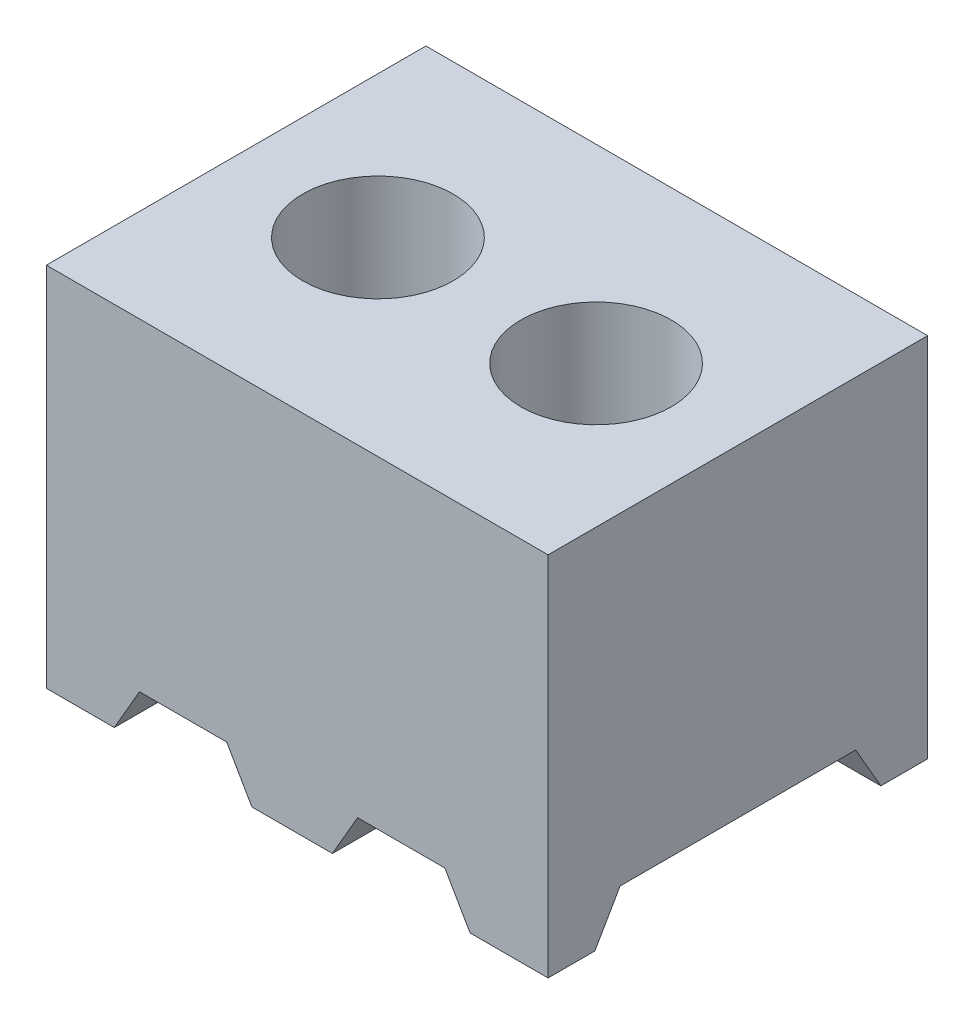
ISO-10303-21;
HEADER;
FILE_DESCRIPTION(('STEP AP214'),'2;1');
FILE_NAME('part.step','',(''),(''),'','','');
FILE_SCHEMA(('AUTOMOTIVE_DESIGN { 1 0 10303 214 1 1 1 1 }'));
ENDSEC;
DATA;
#1=APPLICATION_CONTEXT('core data for automotive mechanical design processes');
#2=APPLICATION_PROTOCOL_DEFINITION('international standard','automotive_design',2000,#1);
#3=PRODUCT_CONTEXT('',#1,'mechanical');
#4=PRODUCT('Part','Part','',(#3));
#5=PRODUCT_RELATED_PRODUCT_CATEGORY('part','',(#4));
#6=PRODUCT_DEFINITION_FORMATION('','',#4);
#7=PRODUCT_DEFINITION_CONTEXT('part definition',#1,'design');
#8=PRODUCT_DEFINITION('design','',#6,#7);
#9=PRODUCT_DEFINITION_SHAPE('','',#8);
#10=(LENGTH_UNIT() NAMED_UNIT(*) SI_UNIT(.MILLI.,.METRE.));
#11=(NAMED_UNIT(*) PLANE_ANGLE_UNIT() SI_UNIT($,.RADIAN.));
#12=(NAMED_UNIT(*) SI_UNIT($,.STERADIAN.) SOLID_ANGLE_UNIT());
#13=UNCERTAINTY_MEASURE_WITH_UNIT(LENGTH_MEASURE(1.E-05),#10,'distance_accuracy_value','');
#14=(GEOMETRIC_REPRESENTATION_CONTEXT(3) GLOBAL_UNCERTAINTY_ASSIGNED_CONTEXT((#13)) GLOBAL_UNIT_ASSIGNED_CONTEXT((#10,
#11,#12)) REPRESENTATION_CONTEXT('',''));
#15=CARTESIAN_POINT('',(0.,0.,0.));
#16=DIRECTION('',(0.,0.,1.));
#17=DIRECTION('',(1.,0.,0.));
#18=AXIS2_PLACEMENT_3D('',#15,#16,#17);
#19=CARTESIAN_POINT('',(0.,-2.1336,0.));
#20=DIRECTION('',(0.,1.,0.));
#21=DIRECTION('',(0.,0.,1.));
#22=AXIS2_PLACEMENT_3D('',#19,#20,#21);
#23=PLANE('',#22);
#24=DIRECTION('',(1.,0.,0.));
#25=VECTOR('',#24,1.);
#26=CARTESIAN_POINT('',(0.,-2.1336,0.));
#27=LINE('',#26,#25);
#28=CARTESIAN_POINT('',(2.46681757469933,-2.1336,0.));
#29=VERTEX_POINT('',#28);
#30=CARTESIAN_POINT('',(2.92099999999999,-2.1336,0.));
#31=VERTEX_POINT('',#30);
#32=EDGE_CURVE('E308',#29,#31,#27,.T.);
#33=ORIENTED_EDGE('',*,*,#32,.F.);
#34=DIRECTION('',(0.,0.,1.));
#35=VECTOR('',#34,1.);
#36=CARTESIAN_POINT('',(2.46681757469933,-2.1336,-2.2098));
#37=LINE('',#36,#35);
#38=CARTESIAN_POINT('',(2.46681757469933,-2.1336,-0.272453031625834));
#39=VERTEX_POINT('',#38);
#40=EDGE_CURVE('E217',#39,#29,#37,.T.);
#41=ORIENTED_EDGE('',*,*,#40,.F.);
#42=DIRECTION('',(1.,0.,0.));
#43=VECTOR('',#42,1.);
#44=CARTESIAN_POINT('',(0.,-2.1336,-0.272453031625834));
#45=LINE('',#44,#43);
#46=CARTESIAN_POINT('',(2.92099999999999,-2.1336,-0.272453031625834));
#47=VERTEX_POINT('',#46);
#48=EDGE_CURVE('E27',#39,#47,#45,.T.);
#49=ORIENTED_EDGE('',*,*,#48,.T.);
#50=DIRECTION('',(0.,0.,-1.));
#51=VECTOR('',#50,1.);
#52=CARTESIAN_POINT('',(2.92099999999999,-2.1336,0.));
#53=LINE('',#52,#51);
#54=EDGE_CURVE('E315',#31,#47,#53,.T.);
#55=ORIENTED_EDGE('',*,*,#54,.F.);
#56=EDGE_LOOP('',(#33,#41,#49,#55));
#57=FACE_BOUND('',#56,.T.);
#58=ADVANCED_FACE('F16',(#57),#23,.F.);
#59=DIRECTION('',(-1.,0.,0.));
#60=VECTOR('',#59,1.);
#61=CARTESIAN_POINT('',(0.,-2.1336,-1.93734696837416));
#62=LINE('',#61,#60);
#63=CARTESIAN_POINT('',(2.92099999999999,-2.1336,-1.93734696837416));
#64=VERTEX_POINT('',#63);
#65=CARTESIAN_POINT('',(2.46681757469933,-2.1336,-1.93734696837416));
#66=VERTEX_POINT('',#65);
#67=EDGE_CURVE('E342',#64,#66,#62,.T.);
#68=ORIENTED_EDGE('',*,*,#67,.T.);
#69=CARTESIAN_POINT('',(2.46681757469933,-2.1336,-2.2098));
#70=VERTEX_POINT('',#69);
#71=EDGE_CURVE('E215',#70,#66,#37,.T.);
#72=ORIENTED_EDGE('',*,*,#71,.F.);
#73=DIRECTION('',(-1.,0.,0.));
#74=VECTOR('',#73,1.);
#75=CARTESIAN_POINT('',(2.92099999999999,-2.1336,-2.20979999999999));
#76=LINE('',#75,#74);
#77=CARTESIAN_POINT('',(2.92099999999999,-2.1336,-2.20979999999999));
#78=VERTEX_POINT('',#77);
#79=EDGE_CURVE('E319',#78,#70,#76,.T.);
#80=ORIENTED_EDGE('',*,*,#79,.F.);
#81=EDGE_CURVE('E313',#64,#78,#53,.T.);
#82=ORIENTED_EDGE('',*,*,#81,.F.);
#83=EDGE_LOOP('',(#68,#72,#80,#82));
#84=FACE_BOUND('',#83,.T.);
#85=ADVANCED_FACE('F369',(#84),#23,.F.);
#86=CARTESIAN_POINT('',(-60.96,-1.8796,-0.4191));
#87=DIRECTION('',(0.,0.500000000000004,0.866025403784436));
#88=DIRECTION('',(0.,-0.866025403784436,0.500000000000004));
#89=AXIS2_PLACEMENT_3D('',#86,#87,#88);
#90=PLANE('',#89);
#91=ORIENTED_EDGE('',*,*,#48,.F.);
#92=DIRECTION('',(-0.447213595499954,0.774596669241483,-0.447213595499962));
#93=VECTOR('',#92,1.);
#94=CARTESIAN_POINT('',(-10.3358635149396,20.0412941203562,-13.075134121265));
#95=LINE('',#94,#93);
#96=CARTESIAN_POINT('',(2.32017060632517,-1.8796,-0.4191));
#97=VERTEX_POINT('',#96);
#98=EDGE_CURVE('E226',#39,#97,#95,.T.);
#99=ORIENTED_EDGE('',*,*,#98,.T.);
#100=DIRECTION('',(1.,0.,0.));
#101=VECTOR('',#100,1.);
#102=CARTESIAN_POINT('',(-60.96,-1.8796,-0.4191));
#103=LINE('',#102,#101);
#104=CARTESIAN_POINT('',(2.92099999999999,-1.8796,-0.4191));
#105=VERTEX_POINT('',#104);
#106=EDGE_CURVE('E294',#97,#105,#103,.T.);
#107=ORIENTED_EDGE('',*,*,#106,.T.);
#108=DIRECTION('',(0.,-0.866025403784436,0.500000000000004));
#109=VECTOR('',#108,1.);
#110=CARTESIAN_POINT('',(2.92099999999999,-1.8796,-0.4191));
#111=LINE('',#110,#109);
#112=EDGE_CURVE('E279',#105,#47,#111,.T.);
#113=ORIENTED_EDGE('',*,*,#112,.T.);
#114=EDGE_LOOP('',(#91,#99,#107,#113));
#115=FACE_BOUND('',#114,.T.);
#116=ADVANCED_FACE('F376',(#115),#90,.F.);
#117=CARTESIAN_POINT('',(-60.96,-1.8796,-1.7907));
#118=DIRECTION('',(0.,0.499999999999978,-0.866025403784451));
#119=DIRECTION('',(0.,0.866025403784451,0.499999999999978));
#120=AXIS2_PLACEMENT_3D('',#117,#118,#119);
#121=PLANE('',#120);
#122=DIRECTION('',(1.,0.,0.));
#123=VECTOR('',#122,1.);
#124=CARTESIAN_POINT('',(-60.96,-1.8796,-1.7907));
#125=LINE('',#124,#123);
#126=CARTESIAN_POINT('',(2.32017060632517,-1.8796,-1.7907));
#127=VERTEX_POINT('',#126);
#128=CARTESIAN_POINT('',(2.92099999999999,-1.8796,-1.7907));
#129=VERTEX_POINT('',#128);
#130=EDGE_CURVE('E288',#127,#129,#125,.T.);
#131=ORIENTED_EDGE('',*,*,#130,.F.);
#132=DIRECTION('',(0.44721359549996,-0.774596669241494,-0.447213595499938));
#133=VECTOR('',#132,1.);
#134=CARTESIAN_POINT('',(-10.33586351494,20.0412941203568,10.8653341212645));
#135=LINE('',#134,#133);
#136=EDGE_CURVE('E223',#127,#66,#135,.T.);
#137=ORIENTED_EDGE('',*,*,#136,.T.);
#138=ORIENTED_EDGE('',*,*,#67,.F.);
#139=DIRECTION('',(0.,0.866025403784451,0.499999999999978));
#140=VECTOR('',#139,1.);
#141=CARTESIAN_POINT('',(2.92099999999999,-1.8796,-1.7907));
#142=LINE('',#141,#140);
#143=EDGE_CURVE('E282',#64,#129,#142,.T.);
#144=ORIENTED_EDGE('',*,*,#143,.T.);
#145=EDGE_LOOP('',(#131,#137,#138,#144));
#146=FACE_BOUND('',#145,.T.);
#147=ADVANCED_FACE('F365',(#146),#121,.F.);
#148=CARTESIAN_POINT('',(1.19681757469933,-2.1336,-0.272453031625834));
#149=VERTEX_POINT('',#148);
#150=CARTESIAN_POINT('',(1.665523637951,-2.1336,-0.272453031625838));
#151=VERTEX_POINT('',#150);
#152=EDGE_CURVE('E25',#149,#151,#45,.T.);
#153=ORIENTED_EDGE('',*,*,#152,.T.);
#154=DIRECTION('',(0.,0.,1.));
#155=VECTOR('',#154,1.);
#156=CARTESIAN_POINT('',(1.665523637951,-2.1336,-2.2098));
#157=LINE('',#156,#155);
#158=CARTESIAN_POINT('',(1.665523637951,-2.1336,0.));
#159=VERTEX_POINT('',#158);
#160=EDGE_CURVE('E191',#151,#159,#157,.T.);
#161=ORIENTED_EDGE('',*,*,#160,.T.);
#162=CARTESIAN_POINT('',(1.19681757469933,-2.1336,0.));
#163=VERTEX_POINT('',#162);
#164=EDGE_CURVE('E314',#163,#159,#27,.T.);
#165=ORIENTED_EDGE('',*,*,#164,.F.);
#166=DIRECTION('',(0.,0.,1.));
#167=VECTOR('',#166,1.);
#168=CARTESIAN_POINT('',(1.19681757469933,-2.1336,-2.2098));
#169=LINE('',#168,#167);
#170=EDGE_CURVE('E254',#149,#163,#169,.T.);
#171=ORIENTED_EDGE('',*,*,#170,.F.);
#172=EDGE_LOOP('',(#153,#161,#165,#171));
#173=FACE_BOUND('',#172,.T.);
#174=ADVANCED_FACE('F378',(#173),#23,.F.);
#175=CARTESIAN_POINT('',(1.665523637951,-2.1336,-2.2098));
#176=VERTEX_POINT('',#175);
#177=CARTESIAN_POINT('',(1.19681757469933,-2.1336,-2.2098));
#178=VERTEX_POINT('',#177);
#179=EDGE_CURVE('E322',#176,#178,#76,.T.);
#180=ORIENTED_EDGE('',*,*,#179,.F.);
#181=CARTESIAN_POINT('',(1.665523637951,-2.1336,-1.93734696837416));
#182=VERTEX_POINT('',#181);
#183=EDGE_CURVE('E34',#176,#182,#157,.T.);
#184=ORIENTED_EDGE('',*,*,#183,.T.);
#185=CARTESIAN_POINT('',(1.19681757469933,-2.1336,-1.93734696837416));
#186=VERTEX_POINT('',#185);
#187=EDGE_CURVE('E344',#182,#186,#62,.T.);
#188=ORIENTED_EDGE('',*,*,#187,.T.);
#189=EDGE_CURVE('E251',#178,#186,#169,.T.);
#190=ORIENTED_EDGE('',*,*,#189,.F.);
#191=EDGE_LOOP('',(#180,#184,#188,#190));
#192=FACE_BOUND('',#191,.T.);
#193=ADVANCED_FACE('F398',(#192),#23,.F.);
#194=CARTESIAN_POINT('',(1.05017060632517,-1.8796,-0.4191));
#195=VERTEX_POINT('',#194);
#196=CARTESIAN_POINT('',(1.81217060632517,-1.8796,-0.4191));
#197=VERTEX_POINT('',#196);
#198=EDGE_CURVE('E293',#195,#197,#103,.T.);
#199=ORIENTED_EDGE('',*,*,#198,.T.);
#200=DIRECTION('',(-0.447213595499954,-0.774596669241483,0.447213595499963));
#201=VECTOR('',#200,1.);
#202=CARTESIAN_POINT('',(-10.7422635149396,-23.6245177583072,12.135334121265));
#203=LINE('',#202,#201);
#204=EDGE_CURVE('E220',#197,#151,#203,.T.);
#205=ORIENTED_EDGE('',*,*,#204,.T.);
#206=ORIENTED_EDGE('',*,*,#152,.F.);
#207=DIRECTION('',(-0.447213595499954,0.774596669241483,-0.447213595499962));
#208=VECTOR('',#207,1.);
#209=CARTESIAN_POINT('',(-11.3518635149396,19.6013532152337,-12.8211341212651));
#210=LINE('',#209,#208);
#211=EDGE_CURVE('E269',#149,#195,#210,.T.);
#212=ORIENTED_EDGE('',*,*,#211,.T.);
#213=EDGE_LOOP('',(#199,#205,#206,#212));
#214=FACE_BOUND('',#213,.T.);
#215=ADVANCED_FACE('F404',(#214),#90,.F.);
#216=ORIENTED_EDGE('',*,*,#187,.F.);
#217=DIRECTION('',(0.44721359549996,0.774596669241494,0.447213595499938));
#218=VECTOR('',#217,1.);
#219=CARTESIAN_POINT('',(-10.74226351494,-23.6245177583078,-14.3451341212645));
#220=LINE('',#219,#218);
#221=CARTESIAN_POINT('',(1.81217060632517,-1.8796,-1.7907));
#222=VERTEX_POINT('',#221);
#223=EDGE_CURVE('E213',#182,#222,#220,.T.);
#224=ORIENTED_EDGE('',*,*,#223,.T.);
#225=CARTESIAN_POINT('',(1.05017060632517,-1.8796,-1.7907));
#226=VERTEX_POINT('',#225);
#227=EDGE_CURVE('E189',#226,#222,#125,.T.);
#228=ORIENTED_EDGE('',*,*,#227,.F.);
#229=DIRECTION('',(0.44721359549996,-0.774596669241494,-0.447213595499938));
#230=VECTOR('',#229,1.);
#231=CARTESIAN_POINT('',(-11.35186351494,19.6013532152343,10.6113341212645));
#232=LINE('',#231,#230);
#233=EDGE_CURVE('E266',#226,#186,#232,.T.);
#234=ORIENTED_EDGE('',*,*,#233,.T.);
#235=EDGE_LOOP('',(#216,#224,#228,#234));
#236=FACE_BOUND('',#235,.T.);
#237=ADVANCED_FACE('F366',(#236),#121,.F.);
#238=CARTESIAN_POINT('',(0.,-2.1336,-0.272453031625834));
#239=VERTEX_POINT('',#238);
#240=CARTESIAN_POINT('',(0.395523637951008,-2.1336,-0.272453031625833));
#241=VERTEX_POINT('',#240);
#242=EDGE_CURVE('E11',#239,#241,#45,.T.);
#243=ORIENTED_EDGE('',*,*,#242,.T.);
#244=DIRECTION('',(0.,0.,1.));
#245=VECTOR('',#244,1.);
#246=CARTESIAN_POINT('',(0.395523637951004,-2.1336,-2.2098));
#247=LINE('',#246,#245);
#248=CARTESIAN_POINT('',(0.395523637951004,-2.1336,0.));
#249=VERTEX_POINT('',#248);
#250=EDGE_CURVE('E258',#241,#249,#247,.T.);
#251=ORIENTED_EDGE('',*,*,#250,.T.);
#252=CARTESIAN_POINT('',(0.,-2.1336,0.));
#253=VERTEX_POINT('',#252);
#254=EDGE_CURVE('E310',#253,#249,#27,.T.);
#255=ORIENTED_EDGE('',*,*,#254,.F.);
#256=DIRECTION('',(0.,0.,1.));
#257=VECTOR('',#256,1.);
#258=CARTESIAN_POINT('',(0.,-2.1336,-2.2098));
#259=LINE('',#258,#257);
#260=EDGE_CURVE('E309',#239,#253,#259,.T.);
#261=ORIENTED_EDGE('',*,*,#260,.F.);
#262=EDGE_LOOP('',(#243,#251,#255,#261));
#263=FACE_BOUND('',#262,.T.);
#264=ADVANCED_FACE('F386',(#263),#23,.F.);
#265=CARTESIAN_POINT('',(0.,-2.1336,-2.2098));
#266=DIRECTION('',(-1.,0.,0.));
#267=DIRECTION('',(0.,0.,1.));
#268=AXIS2_PLACEMENT_3D('',#265,#266,#267);
#269=PLANE('',#268);
#270=DIRECTION('',(0.,0.866025403784436,-0.500000000000004));
#271=VECTOR('',#270,1.);
#272=CARTESIAN_POINT('',(0.,-1.2947041547216,-0.756789773719383));
#273=LINE('',#272,#271);
#274=CARTESIAN_POINT('',(0.,-1.8796,-0.4191));
#275=VERTEX_POINT('',#274);
#276=EDGE_CURVE('E300',#239,#275,#273,.T.);
#277=ORIENTED_EDGE('',*,*,#276,.F.);
#278=ORIENTED_EDGE('',*,*,#260,.T.);
#279=DIRECTION('',(0.,1.,0.));
#280=VECTOR('',#279,1.);
#281=CARTESIAN_POINT('',(0.,-2.1336,0.));
#282=LINE('',#281,#280);
#283=CARTESIAN_POINT('',(0.,0.,0.));
#284=VERTEX_POINT('',#283);
#285=EDGE_CURVE('E321',#253,#284,#282,.T.);
#286=ORIENTED_EDGE('',*,*,#285,.T.);
#287=DIRECTION('',(0.,0.,1.));
#288=VECTOR('',#287,1.);
#289=CARTESIAN_POINT('',(0.,0.,-2.2098));
#290=LINE('',#289,#288);
#291=CARTESIAN_POINT('',(0.,0.,-2.2098));
#292=VERTEX_POINT('',#291);
#293=EDGE_CURVE('E304',#292,#284,#290,.T.);
#294=ORIENTED_EDGE('',*,*,#293,.F.);
#295=DIRECTION('',(0.,1.,0.));
#296=VECTOR('',#295,1.);
#297=CARTESIAN_POINT('',(0.,-2.1336,-2.2098));
#298=LINE('',#297,#296);
#299=CARTESIAN_POINT('',(0.,-2.1336,-2.2098));
#300=VERTEX_POINT('',#299);
#301=EDGE_CURVE('E334',#300,#292,#298,.T.);
#302=ORIENTED_EDGE('',*,*,#301,.F.);
#303=CARTESIAN_POINT('',(0.,-2.1336,-1.93734696837416));
#304=VERTEX_POINT('',#303);
#305=EDGE_CURVE('E305',#300,#304,#259,.T.);
#306=ORIENTED_EDGE('',*,*,#305,.T.);
#307=DIRECTION('',(0.,-0.866025403784451,-0.499999999999978));
#308=VECTOR('',#307,1.);
#309=CARTESIAN_POINT('',(0.,-2.25157562336303,-2.00546022628061));
#310=LINE('',#309,#308);
#311=CARTESIAN_POINT('',(0.,-1.8796,-1.7907));
#312=VERTEX_POINT('',#311);
#313=EDGE_CURVE('E292',#312,#304,#310,.T.);
#314=ORIENTED_EDGE('',*,*,#313,.F.);
#315=DIRECTION('',(0.,0.,-1.));
#316=VECTOR('',#315,1.);
#317=CARTESIAN_POINT('',(0.,-1.8796,-2.2098));
#318=LINE('',#317,#316);
#319=EDGE_CURVE('E302',#275,#312,#318,.T.);
#320=ORIENTED_EDGE('',*,*,#319,.F.);
#321=EDGE_LOOP('',(#277,#278,#286,#294,#302,#306,#314,#320));
#322=FACE_BOUND('',#321,.T.);
#323=ADVANCED_FACE('F18',(#322),#269,.T.);
#324=CARTESIAN_POINT('',(2.92099999999999,-2.1336,-2.20979999999999));
#325=DIRECTION('',(0.,0.,-1.));
#326=DIRECTION('',(-1.,0.,0.));
#327=AXIS2_PLACEMENT_3D('',#324,#325,#326);
#328=PLANE('',#327);
#329=DIRECTION('',(-0.499999999999997,0.86602540378444,0.));
#330=VECTOR('',#329,1.);
#331=CARTESIAN_POINT('',(2.46681757469933,-2.1336,-2.2098));
#332=LINE('',#331,#330);
#333=CARTESIAN_POINT('',(2.32017060632517,-1.8796,-2.2098));
#334=VERTEX_POINT('',#333);
#335=EDGE_CURVE('E198',#70,#334,#332,.T.);
#336=ORIENTED_EDGE('',*,*,#335,.T.);
#337=DIRECTION('',(-1.,0.,0.));
#338=VECTOR('',#337,1.);
#339=CARTESIAN_POINT('',(1.81217060632517,-1.8796,-2.2098));
#340=LINE('',#339,#338);
#341=CARTESIAN_POINT('',(1.81217060632517,-1.8796,-2.2098));
#342=VERTEX_POINT('',#341);
#343=EDGE_CURVE('E185',#334,#342,#340,.T.);
#344=ORIENTED_EDGE('',*,*,#343,.T.);
#345=DIRECTION('',(-0.499999999999996,-0.866025403784441,0.));
#346=VECTOR('',#345,1.);
#347=CARTESIAN_POINT('',(1.665523637951,-2.1336,-2.2098));
#348=LINE('',#347,#346);
#349=EDGE_CURVE('E194',#342,#176,#348,.T.);
#350=ORIENTED_EDGE('',*,*,#349,.T.);
#351=ORIENTED_EDGE('',*,*,#179,.T.);
#352=DIRECTION('',(-0.499999999999997,0.86602540378444,0.));
#353=VECTOR('',#352,1.);
#354=CARTESIAN_POINT('',(1.19681757469933,-2.1336,-2.2098));
#355=LINE('',#354,#353);
#356=CARTESIAN_POINT('',(1.05017060632517,-1.8796,-2.2098));
#357=VERTEX_POINT('',#356);
#358=EDGE_CURVE('E237',#178,#357,#355,.T.);
#359=ORIENTED_EDGE('',*,*,#358,.T.);
#360=DIRECTION('',(-1.,0.,0.));
#361=VECTOR('',#360,1.);
#362=CARTESIAN_POINT('',(0.542170606325168,-1.8796,-2.2098));
#363=LINE('',#362,#361);
#364=CARTESIAN_POINT('',(0.542170606325168,-1.8796,-2.2098));
#365=VERTEX_POINT('',#364);
#366=EDGE_CURVE('E230',#357,#365,#363,.T.);
#367=ORIENTED_EDGE('',*,*,#366,.T.);
#368=DIRECTION('',(-0.499999999999996,-0.866025403784441,0.));
#369=VECTOR('',#368,1.);
#370=CARTESIAN_POINT('',(0.395523637951004,-2.1336,-2.2098));
#371=LINE('',#370,#369);
#372=CARTESIAN_POINT('',(0.395523637951004,-2.1336,-2.2098));
#373=VERTEX_POINT('',#372);
#374=EDGE_CURVE('E233',#365,#373,#371,.T.);
#375=ORIENTED_EDGE('',*,*,#374,.T.);
#376=EDGE_CURVE('E318',#373,#300,#76,.T.);
#377=ORIENTED_EDGE('',*,*,#376,.T.);
#378=ORIENTED_EDGE('',*,*,#301,.T.);
#379=DIRECTION('',(-1.,0.,0.));
#380=VECTOR('',#379,1.);
#381=CARTESIAN_POINT('',(2.92099999999999,0.,-2.20979999999999));
#382=LINE('',#381,#380);
#383=CARTESIAN_POINT('',(2.92099999999999,0.,-2.20979999999999));
#384=VERTEX_POINT('',#383);
#385=EDGE_CURVE('E331',#384,#292,#382,.T.);
#386=ORIENTED_EDGE('',*,*,#385,.F.);
#387=DIRECTION('',(0.,1.,0.));
#388=VECTOR('',#387,1.);
#389=CARTESIAN_POINT('',(2.92099999999999,-2.1336,-2.20979999999999));
#390=LINE('',#389,#388);
#391=EDGE_CURVE('E337',#78,#384,#390,.T.);
#392=ORIENTED_EDGE('',*,*,#391,.F.);
#393=ORIENTED_EDGE('',*,*,#79,.T.);
#394=EDGE_LOOP('',(#336,#344,#350,#351,#359,#367,#375,#377,#378,#386,#392,#393));
#395=FACE_BOUND('',#394,.T.);
#396=ADVANCED_FACE('F200',(#395),#328,.T.);
#397=CARTESIAN_POINT('',(2.92099999999999,-2.1336,0.));
#398=DIRECTION('',(1.,0.,0.));
#399=DIRECTION('',(0.,0.,-1.));
#400=AXIS2_PLACEMENT_3D('',#397,#398,#399);
#401=PLANE('',#400);
#402=ORIENTED_EDGE('',*,*,#112,.F.);
#403=DIRECTION('',(0.,0.,1.));
#404=VECTOR('',#403,1.);
#405=CARTESIAN_POINT('',(2.92099999999999,-1.8796,-0.4191));
#406=LINE('',#405,#404);
#407=EDGE_CURVE('E285',#129,#105,#406,.T.);
#408=ORIENTED_EDGE('',*,*,#407,.F.);
#409=ORIENTED_EDGE('',*,*,#143,.F.);
#410=ORIENTED_EDGE('',*,*,#81,.T.);
#411=ORIENTED_EDGE('',*,*,#391,.T.);
#412=DIRECTION('',(0.,0.,-1.));
#413=VECTOR('',#412,1.);
#414=CARTESIAN_POINT('',(2.92099999999999,0.,0.));
#415=LINE('',#414,#413);
#416=CARTESIAN_POINT('',(2.92099999999999,0.,0.));
#417=VERTEX_POINT('',#416);
#418=EDGE_CURVE('E328',#417,#384,#415,.T.);
#419=ORIENTED_EDGE('',*,*,#418,.F.);
#420=DIRECTION('',(0.,1.,0.));
#421=VECTOR('',#420,1.);
#422=CARTESIAN_POINT('',(2.92099999999999,-2.1336,0.));
#423=LINE('',#422,#421);
#424=EDGE_CURVE('E339',#31,#417,#423,.T.);
#425=ORIENTED_EDGE('',*,*,#424,.F.);
#426=ORIENTED_EDGE('',*,*,#54,.T.);
#427=EDGE_LOOP('',(#402,#408,#409,#410,#411,#419,#425,#426));
#428=FACE_BOUND('',#427,.T.);
#429=ADVANCED_FACE('F393',(#428),#401,.T.);
#430=CARTESIAN_POINT('',(0.,-2.1336,0.));
#431=DIRECTION('',(0.,0.,1.));
#432=DIRECTION('',(1.,0.,0.));
#433=AXIS2_PLACEMENT_3D('',#430,#431,#432);
#434=PLANE('',#433);
#435=DIRECTION('',(-0.499999999999997,0.86602540378444,0.));
#436=VECTOR('',#435,1.);
#437=CARTESIAN_POINT('',(2.46681757469933,-2.1336,0.));
#438=LINE('',#437,#436);
#439=CARTESIAN_POINT('',(2.32017060632517,-1.8796,0.));
#440=VERTEX_POINT('',#439);
#441=EDGE_CURVE('E202',#29,#440,#438,.T.);
#442=ORIENTED_EDGE('',*,*,#441,.F.);
#443=ORIENTED_EDGE('',*,*,#32,.T.);
#444=ORIENTED_EDGE('',*,*,#424,.T.);
#445=DIRECTION('',(1.,0.,0.));
#446=VECTOR('',#445,1.);
#447=CARTESIAN_POINT('',(0.,0.,0.));
#448=LINE('',#447,#446);
#449=EDGE_CURVE('E325',#284,#417,#448,.T.);
#450=ORIENTED_EDGE('',*,*,#449,.F.);
#451=ORIENTED_EDGE('',*,*,#285,.F.);
#452=ORIENTED_EDGE('',*,*,#254,.T.);
#453=DIRECTION('',(-0.499999999999996,-0.866025403784441,0.));
#454=VECTOR('',#453,1.);
#455=CARTESIAN_POINT('',(0.395523637951004,-2.1336,0.));
#456=LINE('',#455,#454);
#457=CARTESIAN_POINT('',(0.542170606325168,-1.8796,0.));
#458=VERTEX_POINT('',#457);
#459=EDGE_CURVE('E243',#458,#249,#456,.T.);
#460=ORIENTED_EDGE('',*,*,#459,.F.);
#461=DIRECTION('',(-1.,0.,0.));
#462=VECTOR('',#461,1.);
#463=CARTESIAN_POINT('',(0.542170606325168,-1.8796,0.));
#464=LINE('',#463,#462);
#465=CARTESIAN_POINT('',(1.05017060632517,-1.8796,0.));
#466=VERTEX_POINT('',#465);
#467=EDGE_CURVE('E229',#466,#458,#464,.T.);
#468=ORIENTED_EDGE('',*,*,#467,.F.);
#469=DIRECTION('',(-0.499999999999997,0.86602540378444,0.));
#470=VECTOR('',#469,1.);
#471=CARTESIAN_POINT('',(1.19681757469933,-2.1336,0.));
#472=LINE('',#471,#470);
#473=EDGE_CURVE('E234',#163,#466,#472,.T.);
#474=ORIENTED_EDGE('',*,*,#473,.F.);
#475=ORIENTED_EDGE('',*,*,#164,.T.);
#476=DIRECTION('',(-0.499999999999996,-0.866025403784441,0.));
#477=VECTOR('',#476,1.);
#478=CARTESIAN_POINT('',(1.665523637951,-2.1336,0.));
#479=LINE('',#478,#477);
#480=CARTESIAN_POINT('',(1.81217060632517,-1.8796,0.));
#481=VERTEX_POINT('',#480);
#482=EDGE_CURVE('E205',#481,#159,#479,.T.);
#483=ORIENTED_EDGE('',*,*,#482,.F.);
#484=DIRECTION('',(-1.,0.,0.));
#485=VECTOR('',#484,1.);
#486=CARTESIAN_POINT('',(1.81217060632517,-1.8796,0.));
#487=LINE('',#486,#485);
#488=EDGE_CURVE('E42',#440,#481,#487,.T.);
#489=ORIENTED_EDGE('',*,*,#488,.F.);
#490=EDGE_LOOP('',(#442,#443,#444,#450,#451,#452,#460,#468,#474,#475,#483,#489));
#491=FACE_BOUND('',#490,.T.);
#492=ADVANCED_FACE('F384',(#491),#434,.T.);
#493=ORIENTED_EDGE('',*,*,#376,.F.);
#494=CARTESIAN_POINT('',(0.395523637951003,-2.1336,-1.93734696837416));
#495=VERTEX_POINT('',#494);
#496=EDGE_CURVE('E255',#373,#495,#247,.T.);
#497=ORIENTED_EDGE('',*,*,#496,.T.);
#498=EDGE_CURVE('E336',#495,#304,#62,.T.);
#499=ORIENTED_EDGE('',*,*,#498,.T.);
#500=ORIENTED_EDGE('',*,*,#305,.F.);
#501=EDGE_LOOP('',(#493,#497,#499,#500));
#502=FACE_BOUND('',#501,.T.);
#503=ADVANCED_FACE('F372',(#502),#23,.F.);
#504=CARTESIAN_POINT('',(0.,0.,0.));
#505=DIRECTION('',(0.,1.,0.));
#506=DIRECTION('',(0.,0.,1.));
#507=AXIS2_PLACEMENT_3D('',#504,#505,#506);
#508=PLANE('',#507);
#509=CARTESIAN_POINT('',(2.09550000000001,0.,-1.1049));
#510=DIRECTION('',(0.,1.,0.));
#511=DIRECTION('',(0.,0.,1.));
#512=AXIS2_PLACEMENT_3D('',#509,#510,#511);
#513=CIRCLE('',#512,0.438150000000013);
#514=CARTESIAN_POINT('',(2.09550000000001,0.,-0.666749999999983));
#515=VERTEX_POINT('',#514);
#516=EDGE_CURVE('E272',#515,#515,#513,.T.);
#517=ORIENTED_EDGE('',*,*,#516,.F.);
#518=EDGE_LOOP('',(#517));
#519=FACE_BOUND('',#518,.T.);
#520=CARTESIAN_POINT('',(0.825500000000005,0.,-1.1049));
#521=DIRECTION('',(0.,1.,0.));
#522=DIRECTION('',(0.,0.,1.));
#523=AXIS2_PLACEMENT_3D('',#520,#521,#522);
#524=CIRCLE('',#523,0.438150000000013);
#525=CARTESIAN_POINT('',(0.825500000000005,0.,-0.666749999999987));
#526=VERTEX_POINT('',#525);
#527=EDGE_CURVE('E275',#526,#526,#524,.T.);
#528=ORIENTED_EDGE('',*,*,#527,.F.);
#529=EDGE_LOOP('',(#528));
#530=FACE_BOUND('',#529,.T.);
#531=ORIENTED_EDGE('',*,*,#293,.T.);
#532=ORIENTED_EDGE('',*,*,#449,.T.);
#533=ORIENTED_EDGE('',*,*,#418,.T.);
#534=ORIENTED_EDGE('',*,*,#385,.T.);
#535=EDGE_LOOP('',(#531,#532,#533,#534));
#536=FACE_BOUND('',#535,.T.);
#537=ADVANCED_FACE('F383',(#519,#530,#536),#508,.T.);
#538=CARTESIAN_POINT('',(0.542170606325168,-1.8796,-0.4191));
#539=VERTEX_POINT('',#538);
#540=EDGE_CURVE('E289',#275,#539,#103,.T.);
#541=ORIENTED_EDGE('',*,*,#540,.T.);
#542=DIRECTION('',(-0.447213595499954,-0.774596669241483,0.447213595499963));
#543=VECTOR('',#542,1.);
#544=CARTESIAN_POINT('',(-11.7582635149396,-23.1845768531847,11.881334121265));
#545=LINE('',#544,#543);
#546=EDGE_CURVE('E263',#539,#241,#545,.T.);
#547=ORIENTED_EDGE('',*,*,#546,.T.);
#548=ORIENTED_EDGE('',*,*,#242,.F.);
#549=ORIENTED_EDGE('',*,*,#276,.T.);
#550=EDGE_LOOP('',(#541,#547,#548,#549));
#551=FACE_BOUND('',#550,.T.);
#552=ADVANCED_FACE('F391',(#551),#90,.F.);
#553=CARTESIAN_POINT('',(-60.96,-1.8796,-0.4191));
#554=DIRECTION('',(0.,1.,0.));
#555=DIRECTION('',(0.,0.,1.));
#556=AXIS2_PLACEMENT_3D('',#553,#554,#555);
#557=PLANE('',#556);
#558=CARTESIAN_POINT('',(2.09550000000001,-1.8796,-1.1049));
#559=DIRECTION('',(0.,1.,0.));
#560=DIRECTION('',(0.,0.,1.));
#561=AXIS2_PLACEMENT_3D('',#558,#559,#560);
#562=CIRCLE('',#561,0.438150000000013);
#563=CARTESIAN_POINT('',(2.09550000000001,-1.8796,-0.666749999999983));
#564=VERTEX_POINT('',#563);
#565=EDGE_CURVE('E20',#564,#564,#562,.T.);
#566=ORIENTED_EDGE('',*,*,#565,.T.);
#567=EDGE_LOOP('',(#566));
#568=FACE_BOUND('',#567,.T.);
#569=CARTESIAN_POINT('',(0.825500000000005,-1.8796,-1.1049));
#570=DIRECTION('',(0.,1.,0.));
#571=DIRECTION('',(0.,0.,1.));
#572=AXIS2_PLACEMENT_3D('',#569,#570,#571);
#573=CIRCLE('',#572,0.438150000000013);
#574=CARTESIAN_POINT('',(0.825500000000005,-1.8796,-0.666749999999987));
#575=VERTEX_POINT('',#574);
#576=EDGE_CURVE('E278',#575,#575,#573,.T.);
#577=ORIENTED_EDGE('',*,*,#576,.T.);
#578=EDGE_LOOP('',(#577));
#579=FACE_BOUND('',#578,.T.);
#580=ORIENTED_EDGE('',*,*,#227,.T.);
#581=DIRECTION('',(0.,0.,1.));
#582=VECTOR('',#581,1.);
#583=CARTESIAN_POINT('',(1.81217060632517,-1.8796,-2.2098));
#584=LINE('',#583,#582);
#585=EDGE_CURVE('E181',#342,#222,#584,.T.);
#586=ORIENTED_EDGE('',*,*,#585,.F.);
#587=ORIENTED_EDGE('',*,*,#343,.F.);
#588=DIRECTION('',(0.,0.,1.));
#589=VECTOR('',#588,1.);
#590=CARTESIAN_POINT('',(2.32017060632517,-1.8796,-2.2098));
#591=LINE('',#590,#589);
#592=EDGE_CURVE('E211',#334,#127,#591,.T.);
#593=ORIENTED_EDGE('',*,*,#592,.T.);
#594=ORIENTED_EDGE('',*,*,#130,.T.);
#595=ORIENTED_EDGE('',*,*,#407,.T.);
#596=ORIENTED_EDGE('',*,*,#106,.F.);
#597=EDGE_CURVE('E214',#97,#440,#591,.T.);
#598=ORIENTED_EDGE('',*,*,#597,.T.);
#599=ORIENTED_EDGE('',*,*,#488,.T.);
#600=EDGE_CURVE('E192',#197,#481,#584,.T.);
#601=ORIENTED_EDGE('',*,*,#600,.F.);
#602=ORIENTED_EDGE('',*,*,#198,.F.);
#603=DIRECTION('',(0.,0.,1.));
#604=VECTOR('',#603,1.);
#605=CARTESIAN_POINT('',(1.05017060632517,-1.8796,-2.2098));
#606=LINE('',#605,#604);
#607=EDGE_CURVE('E250',#195,#466,#606,.T.);
#608=ORIENTED_EDGE('',*,*,#607,.T.);
#609=ORIENTED_EDGE('',*,*,#467,.T.);
#610=DIRECTION('',(0.,0.,1.));
#611=VECTOR('',#610,1.);
#612=CARTESIAN_POINT('',(0.542170606325168,-1.8796,-2.2098));
#613=LINE('',#612,#611);
#614=EDGE_CURVE('E240',#539,#458,#613,.T.);
#615=ORIENTED_EDGE('',*,*,#614,.F.);
#616=ORIENTED_EDGE('',*,*,#540,.F.);
#617=ORIENTED_EDGE('',*,*,#319,.T.);
#618=CARTESIAN_POINT('',(0.542170606325169,-1.8796,-1.7907));
#619=VERTEX_POINT('',#618);
#620=EDGE_CURVE('E295',#312,#619,#125,.T.);
#621=ORIENTED_EDGE('',*,*,#620,.T.);
#622=EDGE_CURVE('E259',#365,#619,#613,.T.);
#623=ORIENTED_EDGE('',*,*,#622,.F.);
#624=ORIENTED_EDGE('',*,*,#366,.F.);
#625=EDGE_CURVE('E247',#357,#226,#606,.T.);
#626=ORIENTED_EDGE('',*,*,#625,.T.);
#627=EDGE_LOOP('',(#580,#586,#587,#593,#594,#595,#596,#598,#599,#601,#602,#608,#609,#615,#616,
#617,#621,#623,#624,#626));
#628=FACE_BOUND('',#627,.T.);
#629=ADVANCED_FACE('F182',(#568,#579,#628),#557,.F.);
#630=ORIENTED_EDGE('',*,*,#498,.F.);
#631=DIRECTION('',(0.44721359549996,0.774596669241494,0.447213595499938));
#632=VECTOR('',#631,1.);
#633=CARTESIAN_POINT('',(-11.75826351494,-23.1845768531853,-14.0911341212645));
#634=LINE('',#633,#632);
#635=EDGE_CURVE('E249',#495,#619,#634,.T.);
#636=ORIENTED_EDGE('',*,*,#635,.T.);
#637=ORIENTED_EDGE('',*,*,#620,.F.);
#638=ORIENTED_EDGE('',*,*,#313,.T.);
#639=EDGE_LOOP('',(#630,#636,#637,#638));
#640=FACE_BOUND('',#639,.T.);
#641=ADVANCED_FACE('F352',(#640),#121,.F.);
#642=CARTESIAN_POINT('',(0.825500000000005,0.,-1.1049));
#643=DIRECTION('',(0.,1.,0.));
#644=DIRECTION('',(0.,0.,1.));
#645=AXIS2_PLACEMENT_3D('',#642,#643,#644);
#646=CYLINDRICAL_SURFACE('',#645,0.438150000000013);
#647=ORIENTED_EDGE('',*,*,#527,.T.);
#648=EDGE_LOOP('',(#647));
#649=FACE_BOUND('',#648,.T.);
#650=ORIENTED_EDGE('',*,*,#576,.F.);
#651=EDGE_LOOP('',(#650));
#652=FACE_BOUND('',#651,.T.);
#653=ADVANCED_FACE('F349',(#649,#652),#646,.F.);
#654=CARTESIAN_POINT('',(2.09550000000001,0.,-1.1049));
#655=DIRECTION('',(0.,1.,0.));
#656=DIRECTION('',(0.,0.,1.));
#657=AXIS2_PLACEMENT_3D('',#654,#655,#656);
#658=CYLINDRICAL_SURFACE('',#657,0.438150000000013);
#659=ORIENTED_EDGE('',*,*,#516,.T.);
#660=EDGE_LOOP('',(#659));
#661=FACE_BOUND('',#660,.T.);
#662=ORIENTED_EDGE('',*,*,#565,.F.);
#663=EDGE_LOOP('',(#662));
#664=FACE_BOUND('',#663,.T.);
#665=ADVANCED_FACE('F351',(#661,#664),#658,.F.);
#666=CARTESIAN_POINT('',(1.19681757469933,-2.1336,-2.2098));
#667=DIRECTION('',(0.866025403784441,0.499999999999997,0.));
#668=DIRECTION('',(-0.499999999999997,0.866025403784441,0.));
#669=AXIS2_PLACEMENT_3D('',#666,#667,#668);
#670=PLANE('',#669);
#671=ORIENTED_EDGE('',*,*,#625,.F.);
#672=ORIENTED_EDGE('',*,*,#358,.F.);
#673=ORIENTED_EDGE('',*,*,#189,.T.);
#674=ORIENTED_EDGE('',*,*,#233,.F.);
#675=EDGE_LOOP('',(#671,#672,#673,#674));
#676=FACE_BOUND('',#675,.T.);
#677=ADVANCED_FACE('F360',(#676),#670,.F.);
#678=CARTESIAN_POINT('',(0.395523637951004,-2.1336,-2.2098));
#679=DIRECTION('',(-0.866025403784441,0.499999999999996,0.));
#680=DIRECTION('',(-0.499999999999996,-0.866025403784441,0.));
#681=AXIS2_PLACEMENT_3D('',#678,#679,#680);
#682=PLANE('',#681);
#683=ORIENTED_EDGE('',*,*,#496,.F.);
#684=ORIENTED_EDGE('',*,*,#374,.F.);
#685=ORIENTED_EDGE('',*,*,#622,.T.);
#686=ORIENTED_EDGE('',*,*,#635,.F.);
#687=EDGE_LOOP('',(#683,#684,#685,#686));
#688=FACE_BOUND('',#687,.T.);
#689=ADVANCED_FACE('F476',(#688),#682,.F.);
#690=ORIENTED_EDGE('',*,*,#170,.T.);
#691=ORIENTED_EDGE('',*,*,#473,.T.);
#692=ORIENTED_EDGE('',*,*,#607,.F.);
#693=ORIENTED_EDGE('',*,*,#211,.F.);
#694=EDGE_LOOP('',(#690,#691,#692,#693));
#695=FACE_BOUND('',#694,.T.);
#696=ADVANCED_FACE('F471',(#695),#670,.F.);
#697=ORIENTED_EDGE('',*,*,#614,.T.);
#698=ORIENTED_EDGE('',*,*,#459,.T.);
#699=ORIENTED_EDGE('',*,*,#250,.F.);
#700=ORIENTED_EDGE('',*,*,#546,.F.);
#701=EDGE_LOOP('',(#697,#698,#699,#700));
#702=FACE_BOUND('',#701,.T.);
#703=ADVANCED_FACE('F473',(#702),#682,.F.);
#704=CARTESIAN_POINT('',(1.665523637951,-2.1336,-2.2098));
#705=DIRECTION('',(-0.866025403784441,0.499999999999996,0.));
#706=DIRECTION('',(-0.499999999999996,-0.866025403784441,0.));
#707=AXIS2_PLACEMENT_3D('',#704,#705,#706);
#708=PLANE('',#707);
#709=ORIENTED_EDGE('',*,*,#600,.T.);
#710=ORIENTED_EDGE('',*,*,#482,.T.);
#711=ORIENTED_EDGE('',*,*,#160,.F.);
#712=ORIENTED_EDGE('',*,*,#204,.F.);
#713=EDGE_LOOP('',(#709,#710,#711,#712));
#714=FACE_BOUND('',#713,.T.);
#715=ADVANCED_FACE('F462',(#714),#708,.F.);
#716=CARTESIAN_POINT('',(2.46681757469933,-2.1336,-2.2098));
#717=DIRECTION('',(0.866025403784441,0.499999999999997,0.));
#718=DIRECTION('',(-0.499999999999997,0.866025403784441,0.));
#719=AXIS2_PLACEMENT_3D('',#716,#717,#718);
#720=PLANE('',#719);
#721=ORIENTED_EDGE('',*,*,#40,.T.);
#722=ORIENTED_EDGE('',*,*,#441,.T.);
#723=ORIENTED_EDGE('',*,*,#597,.F.);
#724=ORIENTED_EDGE('',*,*,#98,.F.);
#725=EDGE_LOOP('',(#721,#722,#723,#724));
#726=FACE_BOUND('',#725,.T.);
#727=ADVANCED_FACE('F481',(#726),#720,.F.);
#728=ORIENTED_EDGE('',*,*,#592,.F.);
#729=ORIENTED_EDGE('',*,*,#335,.F.);
#730=ORIENTED_EDGE('',*,*,#71,.T.);
#731=ORIENTED_EDGE('',*,*,#136,.F.);
#732=EDGE_LOOP('',(#728,#729,#730,#731));
#733=FACE_BOUND('',#732,.T.);
#734=ADVANCED_FACE('F446',(#733),#720,.F.);
#735=ORIENTED_EDGE('',*,*,#183,.F.);
#736=ORIENTED_EDGE('',*,*,#349,.F.);
#737=ORIENTED_EDGE('',*,*,#585,.T.);
#738=ORIENTED_EDGE('',*,*,#223,.F.);
#739=EDGE_LOOP('',(#735,#736,#737,#738));
#740=FACE_BOUND('',#739,.T.);
#741=ADVANCED_FACE('F195',(#740),#708,.F.);
#742=CLOSED_SHELL('',(#58,#85,#116,#147,#174,#193,#215,#237,#264,#323,#396,#429,#492,#503,#537,
#552,#629,#641,#653,#665,#677,#689,#696,#703,#715,#727,#734,#741));
#743=MANIFOLD_SOLID_BREP('B1',#742);
#744=ADVANCED_BREP_SHAPE_REPRESENTATION('',(#18,#743),#14);
#745=SHAPE_DEFINITION_REPRESENTATION(#9,#744);
ENDSEC;
END-ISO-10303-21;
